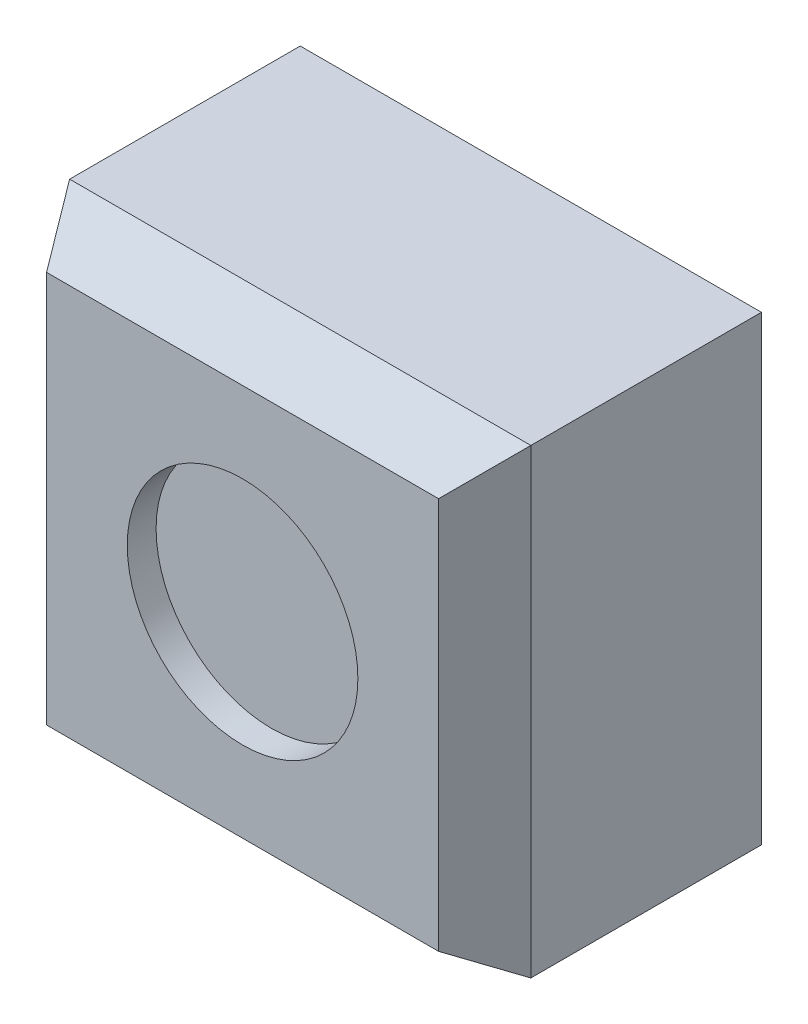
ISO-10303-21;
HEADER;
FILE_DESCRIPTION(('STEP AP214'),'2;1');
FILE_NAME('part.step','',(''),(''),'','','');
FILE_SCHEMA(('AUTOMOTIVE_DESIGN { 1 0 10303 214 1 1 1 1 }'));
ENDSEC;
DATA;
#1=APPLICATION_CONTEXT('core data for automotive mechanical design processes');
#2=APPLICATION_PROTOCOL_DEFINITION('international standard','automotive_design',2000,#1);
#3=PRODUCT_CONTEXT('',#1,'mechanical');
#4=PRODUCT('Part','Part','',(#3));
#5=PRODUCT_RELATED_PRODUCT_CATEGORY('part','',(#4));
#6=PRODUCT_DEFINITION_FORMATION('','',#4);
#7=PRODUCT_DEFINITION_CONTEXT('part definition',#1,'design');
#8=PRODUCT_DEFINITION('design','',#6,#7);
#9=PRODUCT_DEFINITION_SHAPE('','',#8);
#10=(LENGTH_UNIT() NAMED_UNIT(*) SI_UNIT(.MILLI.,.METRE.));
#11=(NAMED_UNIT(*) PLANE_ANGLE_UNIT() SI_UNIT($,.RADIAN.));
#12=(NAMED_UNIT(*) SI_UNIT($,.STERADIAN.) SOLID_ANGLE_UNIT());
#13=UNCERTAINTY_MEASURE_WITH_UNIT(LENGTH_MEASURE(1.E-05),#10,'distance_accuracy_value','');
#14=(GEOMETRIC_REPRESENTATION_CONTEXT(3) GLOBAL_UNCERTAINTY_ASSIGNED_CONTEXT((#13)) GLOBAL_UNIT_ASSIGNED_CONTEXT((#10,
#11,#12)) REPRESENTATION_CONTEXT('',''));
#15=CARTESIAN_POINT('',(0.,0.,0.));
#16=DIRECTION('',(0.,0.,1.));
#17=DIRECTION('',(1.,0.,0.));
#18=AXIS2_PLACEMENT_3D('',#15,#16,#17);
#19=CARTESIAN_POINT('',(0.,0.,10.));
#20=DIRECTION('',(1.,0.,0.));
#21=DIRECTION('',(0.,0.,-1.));
#22=AXIS2_PLACEMENT_3D('',#19,#20,#21);
#23=PLANE('',#22);
#24=DIRECTION('',(0.,0.,-1.));
#25=VECTOR('',#24,1.);
#26=CARTESIAN_POINT('',(0.,0.,10.));
#27=LINE('',#26,#25);
#28=CARTESIAN_POINT('',(0.,0.,8.));
#29=VERTEX_POINT('',#28);
#30=CARTESIAN_POINT('',(0.,0.,0.));
#31=VERTEX_POINT('',#30);
#32=EDGE_CURVE('E103',#29,#31,#27,.T.);
#33=ORIENTED_EDGE('',*,*,#32,.F.);
#34=DIRECTION('',(0.,1.,0.));
#35=VECTOR('',#34,1.);
#36=CARTESIAN_POINT('',(0.,0.,8.));
#37=LINE('',#36,#35);
#38=CARTESIAN_POINT('',(0.,16.,8.));
#39=VERTEX_POINT('',#38);
#40=EDGE_CURVE('E13',#29,#39,#37,.T.);
#41=ORIENTED_EDGE('',*,*,#40,.T.);
#42=DIRECTION('',(0.,0.,-1.));
#43=VECTOR('',#42,1.);
#44=CARTESIAN_POINT('',(0.,16.,10.));
#45=LINE('',#44,#43);
#46=CARTESIAN_POINT('',(0.,16.,0.));
#47=VERTEX_POINT('',#46);
#48=EDGE_CURVE('E125',#39,#47,#45,.T.);
#49=ORIENTED_EDGE('',*,*,#48,.T.);
#50=DIRECTION('',(0.,-1.,0.));
#51=VECTOR('',#50,1.);
#52=CARTESIAN_POINT('',(0.,0.,0.));
#53=LINE('',#52,#51);
#54=EDGE_CURVE('E120',#47,#31,#53,.T.);
#55=ORIENTED_EDGE('',*,*,#54,.T.);
#56=EDGE_LOOP('',(#33,#41,#49,#55));
#57=FACE_BOUND('',#56,.T.);
#58=ADVANCED_FACE('F48',(#57),#23,.F.);
#59=CARTESIAN_POINT('',(0.,0.,10.));
#60=DIRECTION('',(0.,1.,0.));
#61=DIRECTION('',(0.,0.,1.));
#62=AXIS2_PLACEMENT_3D('',#59,#60,#61);
#63=PLANE('',#62);
#64=DIRECTION('',(0.,0.,-1.));
#65=VECTOR('',#64,1.);
#66=CARTESIAN_POINT('',(16.,0.,10.));
#67=LINE('',#66,#65);
#68=CARTESIAN_POINT('',(16.,0.,8.));
#69=VERTEX_POINT('',#68);
#70=CARTESIAN_POINT('',(16.,0.,0.));
#71=VERTEX_POINT('',#70);
#72=EDGE_CURVE('E114',#69,#71,#67,.T.);
#73=ORIENTED_EDGE('',*,*,#72,.F.);
#74=DIRECTION('',(-1.,0.,0.));
#75=VECTOR('',#74,1.);
#76=CARTESIAN_POINT('',(0.,0.,8.));
#77=LINE('',#76,#75);
#78=EDGE_CURVE('E110',#69,#29,#77,.T.);
#79=ORIENTED_EDGE('',*,*,#78,.T.);
#80=ORIENTED_EDGE('',*,*,#32,.T.);
#81=DIRECTION('',(1.,0.,0.));
#82=VECTOR('',#81,1.);
#83=CARTESIAN_POINT('',(0.,0.,0.));
#84=LINE('',#83,#82);
#85=EDGE_CURVE('E107',#31,#71,#84,.T.);
#86=ORIENTED_EDGE('',*,*,#85,.T.);
#87=EDGE_LOOP('',(#73,#79,#80,#86));
#88=FACE_BOUND('',#87,.T.);
#89=ADVANCED_FACE('F106',(#88),#63,.F.);
#90=CARTESIAN_POINT('',(16.,0.,10.));
#91=DIRECTION('',(-1.,0.,0.));
#92=DIRECTION('',(0.,0.,1.));
#93=AXIS2_PLACEMENT_3D('',#90,#91,#92);
#94=PLANE('',#93);
#95=DIRECTION('',(0.,0.,-1.));
#96=VECTOR('',#95,1.);
#97=CARTESIAN_POINT('',(16.,16.,10.));
#98=LINE('',#97,#96);
#99=CARTESIAN_POINT('',(16.,16.,8.));
#100=VERTEX_POINT('',#99);
#101=CARTESIAN_POINT('',(16.,16.,0.));
#102=VERTEX_POINT('',#101);
#103=EDGE_CURVE('E143',#100,#102,#98,.T.);
#104=ORIENTED_EDGE('',*,*,#103,.F.);
#105=DIRECTION('',(0.,-1.,0.));
#106=VECTOR('',#105,1.);
#107=CARTESIAN_POINT('',(16.,0.,8.));
#108=LINE('',#107,#106);
#109=EDGE_CURVE('E162',#100,#69,#108,.T.);
#110=ORIENTED_EDGE('',*,*,#109,.T.);
#111=ORIENTED_EDGE('',*,*,#72,.T.);
#112=DIRECTION('',(0.,1.,0.));
#113=VECTOR('',#112,1.);
#114=CARTESIAN_POINT('',(16.,0.,0.));
#115=LINE('',#114,#113);
#116=EDGE_CURVE('E122',#71,#102,#115,.T.);
#117=ORIENTED_EDGE('',*,*,#116,.T.);
#118=EDGE_LOOP('',(#104,#110,#111,#117));
#119=FACE_BOUND('',#118,.T.);
#120=ADVANCED_FACE('F201',(#119),#94,.F.);
#121=CARTESIAN_POINT('',(0.,16.,10.));
#122=DIRECTION('',(0.,-1.,0.));
#123=DIRECTION('',(0.,0.,-1.));
#124=AXIS2_PLACEMENT_3D('',#121,#122,#123);
#125=PLANE('',#124);
#126=ORIENTED_EDGE('',*,*,#48,.F.);
#127=DIRECTION('',(1.,0.,0.));
#128=VECTOR('',#127,1.);
#129=CARTESIAN_POINT('',(0.,16.,8.));
#130=LINE('',#129,#128);
#131=EDGE_CURVE('E59',#39,#100,#130,.T.);
#132=ORIENTED_EDGE('',*,*,#131,.T.);
#133=ORIENTED_EDGE('',*,*,#103,.T.);
#134=DIRECTION('',(-1.,0.,0.));
#135=VECTOR('',#134,1.);
#136=CARTESIAN_POINT('',(0.,16.,0.));
#137=LINE('',#136,#135);
#138=EDGE_CURVE('E138',#102,#47,#137,.T.);
#139=ORIENTED_EDGE('',*,*,#138,.T.);
#140=EDGE_LOOP('',(#126,#132,#133,#139));
#141=FACE_BOUND('',#140,.T.);
#142=ADVANCED_FACE('F192',(#141),#125,.F.);
#143=CARTESIAN_POINT('',(0.,0.,10.));
#144=DIRECTION('',(0.,0.,-1.));
#145=DIRECTION('',(-1.,0.,0.));
#146=AXIS2_PLACEMENT_3D('',#143,#144,#145);
#147=PLANE('',#146);
#148=DIRECTION('',(0.,-1.,0.));
#149=VECTOR('',#148,1.);
#150=CARTESIAN_POINT('',(1.2,0.,10.));
#151=LINE('',#150,#149);
#152=CARTESIAN_POINT('',(1.2,14.8,10.));
#153=VERTEX_POINT('',#152);
#154=CARTESIAN_POINT('',(1.2,1.2,10.));
#155=VERTEX_POINT('',#154);
#156=EDGE_CURVE('E113',#153,#155,#151,.T.);
#157=ORIENTED_EDGE('',*,*,#156,.T.);
#158=DIRECTION('',(1.,0.,0.));
#159=VECTOR('',#158,1.);
#160=CARTESIAN_POINT('',(0.,1.2,10.));
#161=LINE('',#160,#159);
#162=CARTESIAN_POINT('',(14.8,1.2,10.));
#163=VERTEX_POINT('',#162);
#164=EDGE_CURVE('E156',#155,#163,#161,.T.);
#165=ORIENTED_EDGE('',*,*,#164,.T.);
#166=DIRECTION('',(0.,1.,0.));
#167=VECTOR('',#166,1.);
#168=CARTESIAN_POINT('',(14.8,0.,10.));
#169=LINE('',#168,#167);
#170=CARTESIAN_POINT('',(14.8,14.8,10.));
#171=VERTEX_POINT('',#170);
#172=EDGE_CURVE('E153',#163,#171,#169,.T.);
#173=ORIENTED_EDGE('',*,*,#172,.T.);
#174=DIRECTION('',(-1.,0.,0.));
#175=VECTOR('',#174,1.);
#176=CARTESIAN_POINT('',(0.,14.8,10.));
#177=LINE('',#176,#175);
#178=EDGE_CURVE('E150',#171,#153,#177,.T.);
#179=ORIENTED_EDGE('',*,*,#178,.T.);
#180=EDGE_LOOP('',(#157,#165,#173,#179));
#181=FACE_BOUND('',#180,.T.);
#182=CARTESIAN_POINT('',(8.,8.,10.));
#183=DIRECTION('',(0.,0.,1.));
#184=DIRECTION('',(1.,0.,0.));
#185=AXIS2_PLACEMENT_3D('',#182,#183,#184);
#186=CIRCLE('',#185,4.);
#187=CARTESIAN_POINT('',(12.,8.,10.));
#188=VERTEX_POINT('',#187);
#189=EDGE_CURVE('E132',#188,#188,#186,.T.);
#190=ORIENTED_EDGE('',*,*,#189,.F.);
#191=EDGE_LOOP('',(#190));
#192=FACE_BOUND('',#191,.T.);
#193=ADVANCED_FACE('F190',(#181,#192),#147,.F.);
#194=CARTESIAN_POINT('',(0.,0.,0.));
#195=DIRECTION('',(0.,0.,-1.));
#196=DIRECTION('',(-1.,0.,0.));
#197=AXIS2_PLACEMENT_3D('',#194,#195,#196);
#198=PLANE('',#197);
#199=ORIENTED_EDGE('',*,*,#54,.F.);
#200=ORIENTED_EDGE('',*,*,#138,.F.);
#201=ORIENTED_EDGE('',*,*,#116,.F.);
#202=ORIENTED_EDGE('',*,*,#85,.F.);
#203=EDGE_LOOP('',(#199,#200,#201,#202));
#204=FACE_BOUND('',#203,.T.);
#205=ADVANCED_FACE('F118',(#204),#198,.T.);
#206=CARTESIAN_POINT('',(8.,8.,9.));
#207=DIRECTION('',(0.,0.,1.));
#208=DIRECTION('',(1.,0.,0.));
#209=AXIS2_PLACEMENT_3D('',#206,#207,#208);
#210=CYLINDRICAL_SURFACE('',#209,4.);
#211=CARTESIAN_POINT('',(8.,8.,9.));
#212=DIRECTION('',(0.,0.,1.));
#213=DIRECTION('',(1.,0.,0.));
#214=AXIS2_PLACEMENT_3D('',#211,#212,#213);
#215=CIRCLE('',#214,4.);
#216=CARTESIAN_POINT('',(12.,8.,9.));
#217=VERTEX_POINT('',#216);
#218=EDGE_CURVE('E128',#217,#217,#215,.T.);
#219=ORIENTED_EDGE('',*,*,#218,.F.);
#220=EDGE_LOOP('',(#219));
#221=FACE_BOUND('',#220,.T.);
#222=ORIENTED_EDGE('',*,*,#189,.T.);
#223=EDGE_LOOP('',(#222));
#224=FACE_BOUND('',#223,.T.);
#225=ADVANCED_FACE('F188',(#221,#224),#210,.F.);
#226=CARTESIAN_POINT('',(8.,8.,9.));
#227=DIRECTION('',(0.,0.,1.));
#228=DIRECTION('',(1.,0.,0.));
#229=AXIS2_PLACEMENT_3D('',#226,#227,#228);
#230=PLANE('',#229);
#231=ORIENTED_EDGE('',*,*,#218,.T.);
#232=EDGE_LOOP('',(#231));
#233=FACE_BOUND('',#232,.T.);
#234=ADVANCED_FACE('F233',(#233),#230,.T.);
#235=CARTESIAN_POINT('',(0.,14.8,10.));
#236=DIRECTION('',(0.,-0.857492925712544,-0.514495755427526));
#237=DIRECTION('',(-1.,0.,0.));
#238=AXIS2_PLACEMENT_3D('',#235,#236,#237);
#239=PLANE('',#238);
#240=DIRECTION('',(0.457495710997814,0.457495710997814,-0.762492851663023));
#241=VECTOR('',#240,1.);
#242=CARTESIAN_POINT('',(11.7023255813953,11.7023255813954,15.1627906976744));
#243=LINE('',#242,#241);
#244=EDGE_CURVE('E172',#100,#171,#243,.F.);
#245=ORIENTED_EDGE('',*,*,#244,.F.);
#246=ORIENTED_EDGE('',*,*,#131,.F.);
#247=DIRECTION('',(-0.457495710997814,0.457495710997814,-0.762492851663023));
#248=VECTOR('',#247,1.);
#249=CARTESIAN_POINT('',(4.29767441860465,11.7023255813954,15.1627906976744));
#250=LINE('',#249,#248);
#251=EDGE_CURVE('E53',#153,#39,#250,.T.);
#252=ORIENTED_EDGE('',*,*,#251,.F.);
#253=ORIENTED_EDGE('',*,*,#178,.F.);
#254=EDGE_LOOP('',(#245,#246,#252,#253));
#255=FACE_BOUND('',#254,.T.);
#256=ADVANCED_FACE('F51',(#255),#239,.F.);
#257=CARTESIAN_POINT('',(1.2,0.,10.));
#258=DIRECTION('',(0.857492925712544,0.,-0.514495755427526));
#259=DIRECTION('',(0.,-1.,0.));
#260=AXIS2_PLACEMENT_3D('',#257,#258,#259);
#261=PLANE('',#260);
#262=ORIENTED_EDGE('',*,*,#251,.T.);
#263=ORIENTED_EDGE('',*,*,#40,.F.);
#264=DIRECTION('',(0.457495710997814,0.457495710997814,0.762492851663023));
#265=VECTOR('',#264,1.);
#266=CARTESIAN_POINT('',(0.948837209302326,0.948837209302325,9.58139534883721));
#267=LINE('',#266,#265);
#268=EDGE_CURVE('E170',#155,#29,#267,.F.);
#269=ORIENTED_EDGE('',*,*,#268,.F.);
#270=ORIENTED_EDGE('',*,*,#156,.F.);
#271=EDGE_LOOP('',(#262,#263,#269,#270));
#272=FACE_BOUND('',#271,.T.);
#273=ADVANCED_FACE('F226',(#272),#261,.F.);
#274=CARTESIAN_POINT('',(14.8,0.,10.));
#275=DIRECTION('',(-0.857492925712544,0.,-0.514495755427526));
#276=DIRECTION('',(0.,1.,0.));
#277=AXIS2_PLACEMENT_3D('',#274,#275,#276);
#278=PLANE('',#277);
#279=ORIENTED_EDGE('',*,*,#244,.T.);
#280=ORIENTED_EDGE('',*,*,#172,.F.);
#281=DIRECTION('',(0.457495710997814,-0.457495710997814,-0.762492851663023));
#282=VECTOR('',#281,1.);
#283=CARTESIAN_POINT('',(15.0511627906977,0.948837209302326,9.58139534883721));
#284=LINE('',#283,#282);
#285=EDGE_CURVE('E167',#69,#163,#284,.F.);
#286=ORIENTED_EDGE('',*,*,#285,.F.);
#287=ORIENTED_EDGE('',*,*,#109,.F.);
#288=EDGE_LOOP('',(#279,#280,#286,#287));
#289=FACE_BOUND('',#288,.T.);
#290=ADVANCED_FACE('F220',(#289),#278,.F.);
#291=CARTESIAN_POINT('',(0.,1.2,10.));
#292=DIRECTION('',(0.,0.857492925712544,-0.514495755427526));
#293=DIRECTION('',(1.,0.,0.));
#294=AXIS2_PLACEMENT_3D('',#291,#292,#293);
#295=PLANE('',#294);
#296=ORIENTED_EDGE('',*,*,#268,.T.);
#297=ORIENTED_EDGE('',*,*,#78,.F.);
#298=ORIENTED_EDGE('',*,*,#285,.T.);
#299=ORIENTED_EDGE('',*,*,#164,.F.);
#300=EDGE_LOOP('',(#296,#297,#298,#299));
#301=FACE_BOUND('',#300,.T.);
#302=ADVANCED_FACE('F214',(#301),#295,.F.);
#303=CLOSED_SHELL('',(#58,#89,#120,#142,#193,#205,#225,#234,#256,#273,#290,#302));
#304=MANIFOLD_SOLID_BREP('B2',#303);
#305=ADVANCED_BREP_SHAPE_REPRESENTATION('',(#18,#304),#14);
#306=SHAPE_DEFINITION_REPRESENTATION(#9,#305);
ENDSEC;
END-ISO-10303-21;
